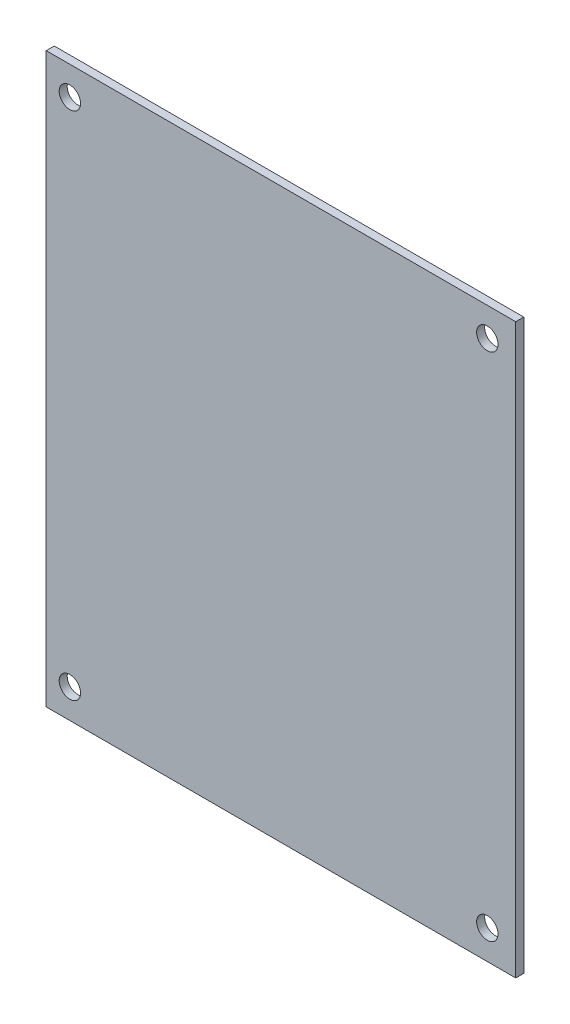
ISO-10303-21;
HEADER;
FILE_DESCRIPTION(('STEP AP214'),'2;1');
FILE_NAME('part.step','',(''),(''),'','','');
FILE_SCHEMA(('AUTOMOTIVE_DESIGN { 1 0 10303 214 1 1 1 1 }'));
ENDSEC;
DATA;
#1=APPLICATION_CONTEXT('core data for automotive mechanical design processes');
#2=APPLICATION_PROTOCOL_DEFINITION('international standard','automotive_design',2000,#1);
#3=PRODUCT_CONTEXT('',#1,'mechanical');
#4=PRODUCT('Part','Part','',(#3));
#5=PRODUCT_RELATED_PRODUCT_CATEGORY('part','',(#4));
#6=PRODUCT_DEFINITION_FORMATION('','',#4);
#7=PRODUCT_DEFINITION_CONTEXT('part definition',#1,'design');
#8=PRODUCT_DEFINITION('design','',#6,#7);
#9=PRODUCT_DEFINITION_SHAPE('','',#8);
#10=(LENGTH_UNIT() NAMED_UNIT(*) SI_UNIT(.MILLI.,.METRE.));
#11=(NAMED_UNIT(*) PLANE_ANGLE_UNIT() SI_UNIT($,.RADIAN.));
#12=(NAMED_UNIT(*) SI_UNIT($,.STERADIAN.) SOLID_ANGLE_UNIT());
#13=UNCERTAINTY_MEASURE_WITH_UNIT(LENGTH_MEASURE(1.E-05),#10,'distance_accuracy_value','');
#14=(GEOMETRIC_REPRESENTATION_CONTEXT(3) GLOBAL_UNCERTAINTY_ASSIGNED_CONTEXT((#13)) GLOBAL_UNIT_ASSIGNED_CONTEXT((#10,
#11,#12)) REPRESENTATION_CONTEXT('',''));
#15=CARTESIAN_POINT('',(0.,0.,0.));
#16=DIRECTION('',(0.,0.,1.));
#17=DIRECTION('',(1.,0.,0.));
#18=AXIS2_PLACEMENT_3D('',#15,#16,#17);
#19=CARTESIAN_POINT('',(0.,0.,1.5));
#20=DIRECTION('',(1.,0.,0.));
#21=DIRECTION('',(0.,0.,-1.));
#22=AXIS2_PLACEMENT_3D('',#19,#20,#21);
#23=PLANE('',#22);
#24=DIRECTION('',(0.,-1.,0.));
#25=VECTOR('',#24,1.);
#26=CARTESIAN_POINT('',(0.,0.,0.));
#27=LINE('',#26,#25);
#28=CARTESIAN_POINT('',(0.,106.2,0.));
#29=VERTEX_POINT('',#28);
#30=CARTESIAN_POINT('',(0.,0.,0.));
#31=VERTEX_POINT('',#30);
#32=EDGE_CURVE('E107',#29,#31,#27,.T.);
#33=ORIENTED_EDGE('',*,*,#32,.T.);
#34=DIRECTION('',(0.,0.,-1.));
#35=VECTOR('',#34,1.);
#36=CARTESIAN_POINT('',(0.,0.,1.5));
#37=LINE('',#36,#35);
#38=CARTESIAN_POINT('',(0.,0.,1.5));
#39=VERTEX_POINT('',#38);
#40=EDGE_CURVE('E11',#39,#31,#37,.T.);
#41=ORIENTED_EDGE('',*,*,#40,.F.);
#42=DIRECTION('',(0.,-1.,0.));
#43=VECTOR('',#42,1.);
#44=CARTESIAN_POINT('',(0.,0.,1.5));
#45=LINE('',#44,#43);
#46=CARTESIAN_POINT('',(0.,106.2,1.5));
#47=VERTEX_POINT('',#46);
#48=EDGE_CURVE('E91',#47,#39,#45,.T.);
#49=ORIENTED_EDGE('',*,*,#48,.F.);
#50=DIRECTION('',(0.,0.,-1.));
#51=VECTOR('',#50,1.);
#52=CARTESIAN_POINT('',(0.,106.2,1.5));
#53=LINE('',#52,#51);
#54=EDGE_CURVE('E103',#47,#29,#53,.T.);
#55=ORIENTED_EDGE('',*,*,#54,.T.);
#56=EDGE_LOOP('',(#33,#41,#49,#55));
#57=FACE_BOUND('',#56,.T.);
#58=ADVANCED_FACE('F39',(#57),#23,.F.);
#59=CARTESIAN_POINT('',(0.,0.,1.5));
#60=DIRECTION('',(0.,1.,0.));
#61=DIRECTION('',(0.,0.,1.));
#62=AXIS2_PLACEMENT_3D('',#59,#60,#61);
#63=PLANE('',#62);
#64=DIRECTION('',(1.,0.,0.));
#65=VECTOR('',#64,1.);
#66=CARTESIAN_POINT('',(0.,0.,0.));
#67=LINE('',#66,#65);
#68=CARTESIAN_POINT('',(87.72,0.,0.));
#69=VERTEX_POINT('',#68);
#70=EDGE_CURVE('E96',#31,#69,#67,.T.);
#71=ORIENTED_EDGE('',*,*,#70,.T.);
#72=DIRECTION('',(0.,0.,-1.));
#73=VECTOR('',#72,1.);
#74=CARTESIAN_POINT('',(87.72,0.,1.5));
#75=LINE('',#74,#73);
#76=CARTESIAN_POINT('',(87.72,0.,1.5));
#77=VERTEX_POINT('',#76);
#78=EDGE_CURVE('E48',#77,#69,#75,.T.);
#79=ORIENTED_EDGE('',*,*,#78,.F.);
#80=DIRECTION('',(1.,0.,0.));
#81=VECTOR('',#80,1.);
#82=CARTESIAN_POINT('',(0.,0.,1.5));
#83=LINE('',#82,#81);
#84=EDGE_CURVE('E86',#39,#77,#83,.T.);
#85=ORIENTED_EDGE('',*,*,#84,.F.);
#86=ORIENTED_EDGE('',*,*,#40,.T.);
#87=EDGE_LOOP('',(#71,#79,#85,#86));
#88=FACE_BOUND('',#87,.T.);
#89=ADVANCED_FACE('F95',(#88),#63,.F.);
#90=CARTESIAN_POINT('',(87.72,0.,1.5));
#91=DIRECTION('',(-1.,0.,0.));
#92=DIRECTION('',(0.,0.,1.));
#93=AXIS2_PLACEMENT_3D('',#90,#91,#92);
#94=PLANE('',#93);
#95=DIRECTION('',(0.,1.,0.));
#96=VECTOR('',#95,1.);
#97=CARTESIAN_POINT('',(87.72,0.,0.));
#98=LINE('',#97,#96);
#99=CARTESIAN_POINT('',(87.72,106.2,0.));
#100=VERTEX_POINT('',#99);
#101=EDGE_CURVE('E73',#69,#100,#98,.T.);
#102=ORIENTED_EDGE('',*,*,#101,.T.);
#103=DIRECTION('',(0.,0.,-1.));
#104=VECTOR('',#103,1.);
#105=CARTESIAN_POINT('',(87.72,106.2,1.5));
#106=LINE('',#105,#104);
#107=CARTESIAN_POINT('',(87.72,106.2,1.5));
#108=VERTEX_POINT('',#107);
#109=EDGE_CURVE('E98',#108,#100,#106,.T.);
#110=ORIENTED_EDGE('',*,*,#109,.F.);
#111=DIRECTION('',(0.,1.,0.));
#112=VECTOR('',#111,1.);
#113=CARTESIAN_POINT('',(87.72,0.,1.5));
#114=LINE('',#113,#112);
#115=EDGE_CURVE('E89',#77,#108,#114,.T.);
#116=ORIENTED_EDGE('',*,*,#115,.F.);
#117=ORIENTED_EDGE('',*,*,#78,.T.);
#118=EDGE_LOOP('',(#102,#110,#116,#117));
#119=FACE_BOUND('',#118,.T.);
#120=ADVANCED_FACE('F99',(#119),#94,.F.);
#121=CARTESIAN_POINT('',(0.,106.2,1.5));
#122=DIRECTION('',(0.,-1.,0.));
#123=DIRECTION('',(0.,0.,-1.));
#124=AXIS2_PLACEMENT_3D('',#121,#122,#123);
#125=PLANE('',#124);
#126=DIRECTION('',(-1.,0.,0.));
#127=VECTOR('',#126,1.);
#128=CARTESIAN_POINT('',(0.,106.2,0.));
#129=LINE('',#128,#127);
#130=EDGE_CURVE('E79',#100,#29,#129,.T.);
#131=ORIENTED_EDGE('',*,*,#130,.T.);
#132=ORIENTED_EDGE('',*,*,#54,.F.);
#133=DIRECTION('',(-1.,0.,0.));
#134=VECTOR('',#133,1.);
#135=CARTESIAN_POINT('',(0.,106.2,1.5));
#136=LINE('',#135,#134);
#137=EDGE_CURVE('E56',#108,#47,#136,.T.);
#138=ORIENTED_EDGE('',*,*,#137,.F.);
#139=ORIENTED_EDGE('',*,*,#109,.T.);
#140=EDGE_LOOP('',(#131,#132,#138,#139));
#141=FACE_BOUND('',#140,.T.);
#142=ADVANCED_FACE('F121',(#141),#125,.F.);
#143=CARTESIAN_POINT('',(0.,0.,1.5));
#144=DIRECTION('',(0.,0.,-1.));
#145=DIRECTION('',(-1.,0.,0.));
#146=AXIS2_PLACEMENT_3D('',#143,#144,#145);
#147=PLANE('',#146);
#148=CARTESIAN_POINT('',(82.4132010054105,100.851121266636,1.5));
#149=DIRECTION('',(0.,0.,1.));
#150=DIRECTION('',(1.,0.,0.));
#151=AXIS2_PLACEMENT_3D('',#148,#149,#150);
#152=CIRCLE('',#151,2.);
#153=CARTESIAN_POINT('',(84.4132010054105,100.851121266636,1.5));
#154=VERTEX_POINT('',#153);
#155=EDGE_CURVE('E136',#154,#154,#152,.T.);
#156=ORIENTED_EDGE('',*,*,#155,.F.);
#157=EDGE_LOOP('',(#156));
#158=FACE_BOUND('',#157,.T.);
#159=CARTESIAN_POINT('',(82.4132010054105,5.45112126663622,1.5));
#160=DIRECTION('',(0.,0.,1.));
#161=DIRECTION('',(1.,0.,0.));
#162=AXIS2_PLACEMENT_3D('',#159,#160,#161);
#163=CIRCLE('',#162,2.);
#164=CARTESIAN_POINT('',(84.4132010054105,5.45112126663622,1.5));
#165=VERTEX_POINT('',#164);
#166=EDGE_CURVE('E144',#165,#165,#163,.T.);
#167=ORIENTED_EDGE('',*,*,#166,.F.);
#168=EDGE_LOOP('',(#167));
#169=FACE_BOUND('',#168,.T.);
#170=CARTESIAN_POINT('',(4.41320100541052,5.45112126663622,1.5));
#171=DIRECTION('',(0.,0.,1.));
#172=DIRECTION('',(1.,0.,0.));
#173=AXIS2_PLACEMENT_3D('',#170,#171,#172);
#174=CIRCLE('',#173,2.);
#175=CARTESIAN_POINT('',(6.41320100541052,5.45112126663622,1.5));
#176=VERTEX_POINT('',#175);
#177=EDGE_CURVE('E152',#176,#176,#174,.T.);
#178=ORIENTED_EDGE('',*,*,#177,.F.);
#179=EDGE_LOOP('',(#178));
#180=FACE_BOUND('',#179,.T.);
#181=CARTESIAN_POINT('',(4.41320100541052,100.851121266636,1.5));
#182=DIRECTION('',(0.,0.,1.));
#183=DIRECTION('',(1.,0.,0.));
#184=AXIS2_PLACEMENT_3D('',#181,#182,#183);
#185=CIRCLE('',#184,2.);
#186=CARTESIAN_POINT('',(6.41320100541053,100.851121266636,1.5));
#187=VERTEX_POINT('',#186);
#188=EDGE_CURVE('E128',#187,#187,#185,.T.);
#189=ORIENTED_EDGE('',*,*,#188,.F.);
#190=EDGE_LOOP('',(#189));
#191=FACE_BOUND('',#190,.T.);
#192=ORIENTED_EDGE('',*,*,#48,.T.);
#193=ORIENTED_EDGE('',*,*,#84,.T.);
#194=ORIENTED_EDGE('',*,*,#115,.T.);
#195=ORIENTED_EDGE('',*,*,#137,.T.);
#196=EDGE_LOOP('',(#192,#193,#194,#195));
#197=FACE_BOUND('',#196,.T.);
#198=ADVANCED_FACE('F87',(#158,#169,#180,#191,#197),#147,.F.);
#199=CARTESIAN_POINT('',(0.,0.,0.));
#200=DIRECTION('',(0.,0.,-1.));
#201=DIRECTION('',(-1.,0.,0.));
#202=AXIS2_PLACEMENT_3D('',#199,#200,#201);
#203=PLANE('',#202);
#204=CARTESIAN_POINT('',(82.4132010054105,100.851121266636,0.));
#205=DIRECTION('',(0.,0.,1.));
#206=DIRECTION('',(1.,0.,0.));
#207=AXIS2_PLACEMENT_3D('',#204,#205,#206);
#208=CIRCLE('',#207,2.);
#209=CARTESIAN_POINT('',(84.4132010054105,100.851121266636,0.));
#210=VERTEX_POINT('',#209);
#211=EDGE_CURVE('E140',#210,#210,#208,.T.);
#212=ORIENTED_EDGE('',*,*,#211,.T.);
#213=EDGE_LOOP('',(#212));
#214=FACE_BOUND('',#213,.T.);
#215=CARTESIAN_POINT('',(82.4132010054105,5.45112126663622,0.));
#216=DIRECTION('',(0.,0.,1.));
#217=DIRECTION('',(1.,0.,0.));
#218=AXIS2_PLACEMENT_3D('',#215,#216,#217);
#219=CIRCLE('',#218,2.);
#220=CARTESIAN_POINT('',(84.4132010054105,5.45112126663622,0.));
#221=VERTEX_POINT('',#220);
#222=EDGE_CURVE('E148',#221,#221,#219,.T.);
#223=ORIENTED_EDGE('',*,*,#222,.T.);
#224=EDGE_LOOP('',(#223));
#225=FACE_BOUND('',#224,.T.);
#226=CARTESIAN_POINT('',(4.41320100541052,5.45112126663622,0.));
#227=DIRECTION('',(0.,0.,1.));
#228=DIRECTION('',(1.,0.,0.));
#229=AXIS2_PLACEMENT_3D('',#226,#227,#228);
#230=CIRCLE('',#229,2.);
#231=CARTESIAN_POINT('',(6.41320100541052,5.45112126663622,0.));
#232=VERTEX_POINT('',#231);
#233=EDGE_CURVE('E132',#232,#232,#230,.T.);
#234=ORIENTED_EDGE('',*,*,#233,.T.);
#235=EDGE_LOOP('',(#234));
#236=FACE_BOUND('',#235,.T.);
#237=CARTESIAN_POINT('',(4.41320100541052,100.851121266636,0.));
#238=DIRECTION('',(0.,0.,1.));
#239=DIRECTION('',(1.,0.,0.));
#240=AXIS2_PLACEMENT_3D('',#237,#238,#239);
#241=CIRCLE('',#240,2.);
#242=CARTESIAN_POINT('',(6.41320100541053,100.851121266636,0.));
#243=VERTEX_POINT('',#242);
#244=EDGE_CURVE('E111',#243,#243,#241,.T.);
#245=ORIENTED_EDGE('',*,*,#244,.T.);
#246=EDGE_LOOP('',(#245));
#247=FACE_BOUND('',#246,.T.);
#248=ORIENTED_EDGE('',*,*,#32,.F.);
#249=ORIENTED_EDGE('',*,*,#130,.F.);
#250=ORIENTED_EDGE('',*,*,#101,.F.);
#251=ORIENTED_EDGE('',*,*,#70,.F.);
#252=EDGE_LOOP('',(#248,#249,#250,#251));
#253=FACE_BOUND('',#252,.T.);
#254=ADVANCED_FACE('F124',(#214,#225,#236,#247,#253),#203,.T.);
#255=CARTESIAN_POINT('',(4.41320100541052,100.851121266636,0.));
#256=DIRECTION('',(0.,0.,1.));
#257=DIRECTION('',(1.,0.,0.));
#258=AXIS2_PLACEMENT_3D('',#255,#256,#257);
#259=CYLINDRICAL_SURFACE('',#258,2.);
#260=ORIENTED_EDGE('',*,*,#244,.F.);
#261=EDGE_LOOP('',(#260));
#262=FACE_BOUND('',#261,.T.);
#263=ORIENTED_EDGE('',*,*,#188,.T.);
#264=EDGE_LOOP('',(#263));
#265=FACE_BOUND('',#264,.T.);
#266=ADVANCED_FACE('F166',(#262,#265),#259,.F.);
#267=CARTESIAN_POINT('',(4.41320100541052,5.45112126663622,0.));
#268=DIRECTION('',(0.,0.,1.));
#269=DIRECTION('',(1.,0.,0.));
#270=AXIS2_PLACEMENT_3D('',#267,#268,#269);
#271=CYLINDRICAL_SURFACE('',#270,2.);
#272=ORIENTED_EDGE('',*,*,#233,.F.);
#273=EDGE_LOOP('',(#272));
#274=FACE_BOUND('',#273,.T.);
#275=ORIENTED_EDGE('',*,*,#177,.T.);
#276=EDGE_LOOP('',(#275));
#277=FACE_BOUND('',#276,.T.);
#278=ADVANCED_FACE('F162',(#274,#277),#271,.F.);
#279=CARTESIAN_POINT('',(82.4132010054105,5.45112126663622,0.));
#280=DIRECTION('',(0.,0.,1.));
#281=DIRECTION('',(1.,0.,0.));
#282=AXIS2_PLACEMENT_3D('',#279,#280,#281);
#283=CYLINDRICAL_SURFACE('',#282,2.);
#284=ORIENTED_EDGE('',*,*,#222,.F.);
#285=EDGE_LOOP('',(#284));
#286=FACE_BOUND('',#285,.T.);
#287=ORIENTED_EDGE('',*,*,#166,.T.);
#288=EDGE_LOOP('',(#287));
#289=FACE_BOUND('',#288,.T.);
#290=ADVANCED_FACE('F165',(#286,#289),#283,.F.);
#291=CARTESIAN_POINT('',(82.4132010054105,100.851121266636,0.));
#292=DIRECTION('',(0.,0.,1.));
#293=DIRECTION('',(1.,0.,0.));
#294=AXIS2_PLACEMENT_3D('',#291,#292,#293);
#295=CYLINDRICAL_SURFACE('',#294,2.);
#296=ORIENTED_EDGE('',*,*,#211,.F.);
#297=EDGE_LOOP('',(#296));
#298=FACE_BOUND('',#297,.T.);
#299=ORIENTED_EDGE('',*,*,#155,.T.);
#300=EDGE_LOOP('',(#299));
#301=FACE_BOUND('',#300,.T.);
#302=ADVANCED_FACE('F227',(#298,#301),#295,.F.);
#303=CLOSED_SHELL('',(#58,#89,#120,#142,#198,#254,#266,#278,#290,#302));
#304=MANIFOLD_SOLID_BREP('B2',#303);
#305=ADVANCED_BREP_SHAPE_REPRESENTATION('',(#18,#304),#14);
#306=SHAPE_DEFINITION_REPRESENTATION(#9,#305);
ENDSEC;
END-ISO-10303-21;
